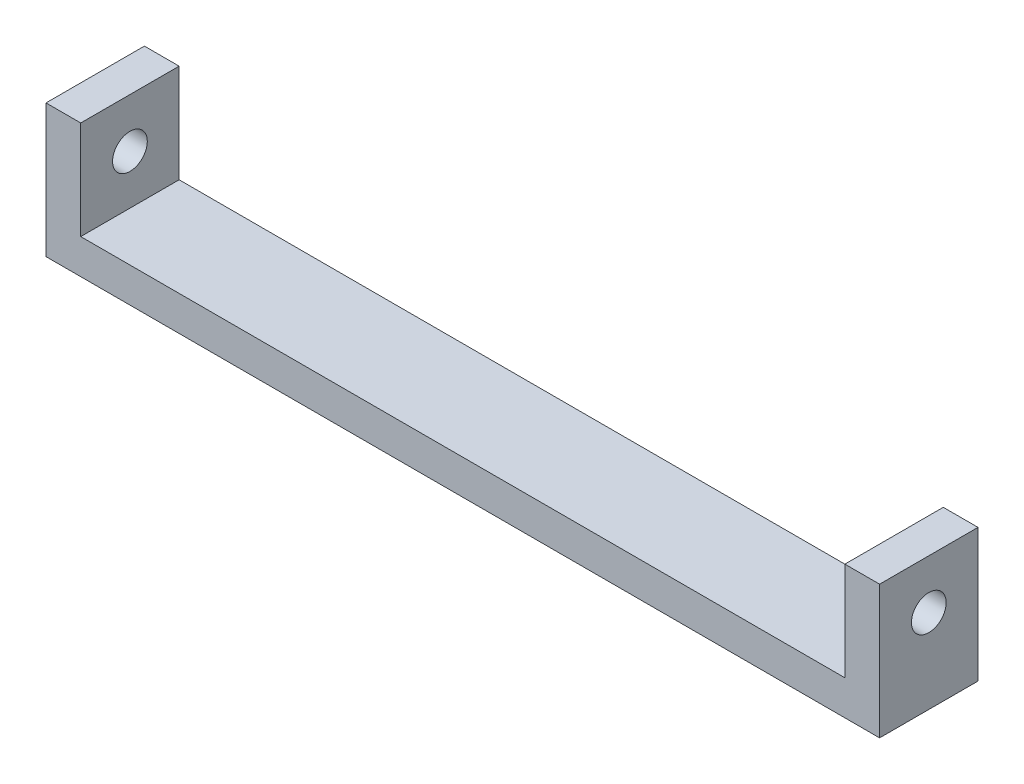
ISO-10303-21;
HEADER;
FILE_DESCRIPTION(('STEP AP214'),'2;1');
FILE_NAME('part.step','',(''),(''),'','','');
FILE_SCHEMA(('AUTOMOTIVE_DESIGN { 1 0 10303 214 1 1 1 1 }'));
ENDSEC;
DATA;
#1=APPLICATION_CONTEXT('core data for automotive mechanical design processes');
#2=APPLICATION_PROTOCOL_DEFINITION('international standard','automotive_design',2000,#1);
#3=PRODUCT_CONTEXT('',#1,'mechanical');
#4=PRODUCT('Part','Part','',(#3));
#5=PRODUCT_RELATED_PRODUCT_CATEGORY('part','',(#4));
#6=PRODUCT_DEFINITION_FORMATION('','',#4);
#7=PRODUCT_DEFINITION_CONTEXT('part definition',#1,'design');
#8=PRODUCT_DEFINITION('design','',#6,#7);
#9=PRODUCT_DEFINITION_SHAPE('','',#8);
#10=(LENGTH_UNIT() NAMED_UNIT(*) SI_UNIT(.MILLI.,.METRE.));
#11=(NAMED_UNIT(*) PLANE_ANGLE_UNIT() SI_UNIT($,.RADIAN.));
#12=(NAMED_UNIT(*) SI_UNIT($,.STERADIAN.) SOLID_ANGLE_UNIT());
#13=UNCERTAINTY_MEASURE_WITH_UNIT(LENGTH_MEASURE(1.E-05),#10,'distance_accuracy_value','');
#14=(GEOMETRIC_REPRESENTATION_CONTEXT(3) GLOBAL_UNCERTAINTY_ASSIGNED_CONTEXT((#13)) GLOBAL_UNIT_ASSIGNED_CONTEXT((#10,
#11,#12)) REPRESENTATION_CONTEXT('',''));
#15=CARTESIAN_POINT('',(0.,0.,0.));
#16=DIRECTION('',(0.,0.,1.));
#17=DIRECTION('',(1.,0.,0.));
#18=AXIS2_PLACEMENT_3D('',#15,#16,#17);
#19=CARTESIAN_POINT('',(5.,-4.25,-4.25));
#20=DIRECTION('',(0.,0.,1.));
#21=DIRECTION('',(1.,0.,0.));
#22=AXIS2_PLACEMENT_3D('',#19,#20,#21);
#23=PLANE('',#22);
#24=DIRECTION('',(0.,1.,0.));
#25=VECTOR('',#24,1.);
#26=CARTESIAN_POINT('',(74.,4.25,-4.25));
#27=LINE('',#26,#25);
#28=CARTESIAN_POINT('',(74.,-7.25,-4.25));
#29=VERTEX_POINT('',#28);
#30=CARTESIAN_POINT('',(74.,4.25,-4.25));
#31=VERTEX_POINT('',#30);
#32=EDGE_CURVE('E60',#29,#31,#27,.T.);
#33=ORIENTED_EDGE('',*,*,#32,.F.);
#34=DIRECTION('',(1.,0.,0.));
#35=VECTOR('',#34,1.);
#36=CARTESIAN_POINT('',(-2.,-7.25,-4.25));
#37=LINE('',#36,#35);
#38=CARTESIAN_POINT('',(2.,-7.25,-4.25));
#39=VERTEX_POINT('',#38);
#40=EDGE_CURVE('E125',#39,#29,#37,.T.);
#41=ORIENTED_EDGE('',*,*,#40,.F.);
#42=DIRECTION('',(0.,-1.,0.));
#43=VECTOR('',#42,1.);
#44=CARTESIAN_POINT('',(2.,4.25,-4.25));
#45=LINE('',#44,#43);
#46=CARTESIAN_POINT('',(2.,4.25,-4.25));
#47=VERTEX_POINT('',#46);
#48=EDGE_CURVE('E68',#47,#39,#45,.T.);
#49=ORIENTED_EDGE('',*,*,#48,.F.);
#50=DIRECTION('',(-1.,0.,0.));
#51=VECTOR('',#50,1.);
#52=CARTESIAN_POINT('',(5.,4.25,-4.25));
#53=LINE('',#52,#51);
#54=CARTESIAN_POINT('',(5.,4.25,-4.25));
#55=VERTEX_POINT('',#54);
#56=EDGE_CURVE('E11',#55,#47,#53,.T.);
#57=ORIENTED_EDGE('',*,*,#56,.F.);
#58=DIRECTION('',(0.,1.,0.));
#59=VECTOR('',#58,1.);
#60=CARTESIAN_POINT('',(5.,-4.25,-4.25));
#61=LINE('',#60,#59);
#62=CARTESIAN_POINT('',(5.,-4.25,-4.25));
#63=VERTEX_POINT('',#62);
#64=EDGE_CURVE('E133',#63,#55,#61,.T.);
#65=ORIENTED_EDGE('',*,*,#64,.F.);
#66=DIRECTION('',(1.,0.,0.));
#67=VECTOR('',#66,1.);
#68=CARTESIAN_POINT('',(-2.,-4.25,-4.25));
#69=LINE('',#68,#67);
#70=CARTESIAN_POINT('',(71.,-4.25,-4.25));
#71=VERTEX_POINT('',#70);
#72=EDGE_CURVE('E144',#63,#71,#69,.T.);
#73=ORIENTED_EDGE('',*,*,#72,.T.);
#74=DIRECTION('',(0.,-1.,0.));
#75=VECTOR('',#74,1.);
#76=CARTESIAN_POINT('',(71.,15.2613577727726,-4.25));
#77=LINE('',#76,#75);
#78=CARTESIAN_POINT('',(71.,4.25,-4.25));
#79=VERTEX_POINT('',#78);
#80=EDGE_CURVE('E225',#79,#71,#77,.T.);
#81=ORIENTED_EDGE('',*,*,#80,.F.);
#82=DIRECTION('',(1.,0.,0.));
#83=VECTOR('',#82,1.);
#84=CARTESIAN_POINT('',(78.,4.25,-4.25));
#85=LINE('',#84,#83);
#86=EDGE_CURVE('E148',#79,#31,#85,.T.);
#87=ORIENTED_EDGE('',*,*,#86,.T.);
#88=EDGE_LOOP('',(#33,#41,#49,#57,#65,#73,#81,#87));
#89=FACE_BOUND('',#88,.T.);
#90=ADVANCED_FACE('F43',(#89),#23,.F.);
#91=CARTESIAN_POINT('',(5.,-4.25,4.25));
#92=DIRECTION('',(0.,0.,-1.));
#93=DIRECTION('',(-1.,0.,0.));
#94=AXIS2_PLACEMENT_3D('',#91,#92,#93);
#95=PLANE('',#94);
#96=DIRECTION('',(0.,-1.,0.));
#97=VECTOR('',#96,1.);
#98=CARTESIAN_POINT('',(74.,4.25,4.25));
#99=LINE('',#98,#97);
#100=CARTESIAN_POINT('',(74.,4.25,4.25));
#101=VERTEX_POINT('',#100);
#102=CARTESIAN_POINT('',(74.,-7.25,4.25));
#103=VERTEX_POINT('',#102);
#104=EDGE_CURVE('E109',#101,#103,#99,.T.);
#105=ORIENTED_EDGE('',*,*,#104,.F.);
#106=DIRECTION('',(-1.,0.,0.));
#107=VECTOR('',#106,1.);
#108=CARTESIAN_POINT('',(78.,4.25,4.25));
#109=LINE('',#108,#107);
#110=CARTESIAN_POINT('',(71.,4.25,4.25));
#111=VERTEX_POINT('',#110);
#112=EDGE_CURVE('E216',#101,#111,#109,.T.);
#113=ORIENTED_EDGE('',*,*,#112,.T.);
#114=DIRECTION('',(0.,-1.,0.));
#115=VECTOR('',#114,1.);
#116=CARTESIAN_POINT('',(71.,15.2613577727726,4.25));
#117=LINE('',#116,#115);
#118=CARTESIAN_POINT('',(71.,-4.25,4.25));
#119=VERTEX_POINT('',#118);
#120=EDGE_CURVE('E222',#111,#119,#117,.T.);
#121=ORIENTED_EDGE('',*,*,#120,.T.);
#122=DIRECTION('',(-1.,0.,0.));
#123=VECTOR('',#122,1.);
#124=CARTESIAN_POINT('',(-2.,-4.25,4.25));
#125=LINE('',#124,#123);
#126=CARTESIAN_POINT('',(5.,-4.25,4.25));
#127=VERTEX_POINT('',#126);
#128=EDGE_CURVE('E140',#119,#127,#125,.T.);
#129=ORIENTED_EDGE('',*,*,#128,.T.);
#130=DIRECTION('',(0.,-1.,0.));
#131=VECTOR('',#130,1.);
#132=CARTESIAN_POINT('',(5.,-4.25,4.25));
#133=LINE('',#132,#131);
#134=CARTESIAN_POINT('',(5.,4.25,4.25));
#135=VERTEX_POINT('',#134);
#136=EDGE_CURVE('E153',#135,#127,#133,.T.);
#137=ORIENTED_EDGE('',*,*,#136,.F.);
#138=DIRECTION('',(-1.,0.,0.));
#139=VECTOR('',#138,1.);
#140=CARTESIAN_POINT('',(5.,4.25,4.25));
#141=LINE('',#140,#139);
#142=CARTESIAN_POINT('',(2.,4.25,4.25));
#143=VERTEX_POINT('',#142);
#144=EDGE_CURVE('E52',#135,#143,#141,.T.);
#145=ORIENTED_EDGE('',*,*,#144,.T.);
#146=DIRECTION('',(0.,1.,0.));
#147=VECTOR('',#146,1.);
#148=CARTESIAN_POINT('',(2.,4.25,4.25));
#149=LINE('',#148,#147);
#150=CARTESIAN_POINT('',(2.,-7.25,4.25));
#151=VERTEX_POINT('',#150);
#152=EDGE_CURVE('E131',#151,#143,#149,.T.);
#153=ORIENTED_EDGE('',*,*,#152,.F.);
#154=DIRECTION('',(-1.,0.,0.));
#155=VECTOR('',#154,1.);
#156=CARTESIAN_POINT('',(-2.,-7.25,4.25));
#157=LINE('',#156,#155);
#158=EDGE_CURVE('E123',#103,#151,#157,.T.);
#159=ORIENTED_EDGE('',*,*,#158,.F.);
#160=EDGE_LOOP('',(#105,#113,#121,#129,#137,#145,#153,#159));
#161=FACE_BOUND('',#160,.T.);
#162=ADVANCED_FACE('F129',(#161),#95,.F.);
#163=CARTESIAN_POINT('',(0.,-7.25,0.));
#164=DIRECTION('',(0.,-1.,0.));
#165=DIRECTION('',(0.,0.,-1.));
#166=AXIS2_PLACEMENT_3D('',#163,#164,#165);
#167=PLANE('',#166);
#168=ORIENTED_EDGE('',*,*,#40,.T.);
#169=DIRECTION('',(0.,0.,-1.));
#170=VECTOR('',#169,1.);
#171=CARTESIAN_POINT('',(74.,-7.25,4.25));
#172=LINE('',#171,#170);
#173=EDGE_CURVE('E112',#103,#29,#172,.T.);
#174=ORIENTED_EDGE('',*,*,#173,.F.);
#175=ORIENTED_EDGE('',*,*,#158,.T.);
#176=DIRECTION('',(0.,0.,1.));
#177=VECTOR('',#176,1.);
#178=CARTESIAN_POINT('',(2.,-7.25,-4.25));
#179=LINE('',#178,#177);
#180=EDGE_CURVE('E195',#39,#151,#179,.T.);
#181=ORIENTED_EDGE('',*,*,#180,.F.);
#182=EDGE_LOOP('',(#168,#174,#175,#181));
#183=FACE_BOUND('',#182,.T.);
#184=ADVANCED_FACE('F122',(#183),#167,.T.);
#185=CARTESIAN_POINT('',(5.,4.25,4.25));
#186=DIRECTION('',(0.,-1.,0.));
#187=DIRECTION('',(0.,0.,-1.));
#188=AXIS2_PLACEMENT_3D('',#185,#186,#187);
#189=PLANE('',#188);
#190=DIRECTION('',(0.,0.,1.));
#191=VECTOR('',#190,1.);
#192=CARTESIAN_POINT('',(74.,4.25,4.25));
#193=LINE('',#192,#191);
#194=EDGE_CURVE('E113',#31,#101,#193,.T.);
#195=ORIENTED_EDGE('',*,*,#194,.F.);
#196=ORIENTED_EDGE('',*,*,#86,.F.);
#197=DIRECTION('',(0.,0.,-1.));
#198=VECTOR('',#197,1.);
#199=CARTESIAN_POINT('',(71.,4.25,-4.25));
#200=LINE('',#199,#198);
#201=EDGE_CURVE('E212',#111,#79,#200,.T.);
#202=ORIENTED_EDGE('',*,*,#201,.F.);
#203=ORIENTED_EDGE('',*,*,#112,.F.);
#204=EDGE_LOOP('',(#195,#196,#202,#203));
#205=FACE_BOUND('',#204,.T.);
#206=ADVANCED_FACE('F231',(#205),#189,.F.);
#207=CARTESIAN_POINT('',(5.,4.25,4.25));
#208=DIRECTION('',(0.,-1.,0.));
#209=DIRECTION('',(0.,0.,-1.));
#210=AXIS2_PLACEMENT_3D('',#207,#208,#209);
#211=PLANE('',#210);
#212=DIRECTION('',(0.,0.,-1.));
#213=VECTOR('',#212,1.);
#214=CARTESIAN_POINT('',(2.,4.25,-4.25));
#215=LINE('',#214,#213);
#216=EDGE_CURVE('E200',#143,#47,#215,.T.);
#217=ORIENTED_EDGE('',*,*,#216,.F.);
#218=ORIENTED_EDGE('',*,*,#144,.F.);
#219=DIRECTION('',(0.,0.,1.));
#220=VECTOR('',#219,1.);
#221=CARTESIAN_POINT('',(5.,4.25,4.25));
#222=LINE('',#221,#220);
#223=EDGE_CURVE('E138',#55,#135,#222,.T.);
#224=ORIENTED_EDGE('',*,*,#223,.F.);
#225=ORIENTED_EDGE('',*,*,#56,.T.);
#226=EDGE_LOOP('',(#217,#218,#224,#225));
#227=FACE_BOUND('',#226,.T.);
#228=ADVANCED_FACE('F249',(#227),#211,.F.);
#229=CARTESIAN_POINT('',(0.,-4.25,0.));
#230=DIRECTION('',(0.,-1.,0.));
#231=DIRECTION('',(0.,0.,-1.));
#232=AXIS2_PLACEMENT_3D('',#229,#230,#231);
#233=PLANE('',#232);
#234=DIRECTION('',(0.,0.,1.));
#235=VECTOR('',#234,1.);
#236=CARTESIAN_POINT('',(71.,-4.25,-4.25));
#237=LINE('',#236,#235);
#238=EDGE_CURVE('E211',#71,#119,#237,.T.);
#239=ORIENTED_EDGE('',*,*,#238,.F.);
#240=ORIENTED_EDGE('',*,*,#72,.F.);
#241=DIRECTION('',(0.,0.,-1.));
#242=VECTOR('',#241,1.);
#243=CARTESIAN_POINT('',(5.,-4.25,4.25));
#244=LINE('',#243,#242);
#245=EDGE_CURVE('E157',#127,#63,#244,.T.);
#246=ORIENTED_EDGE('',*,*,#245,.F.);
#247=ORIENTED_EDGE('',*,*,#128,.F.);
#248=EDGE_LOOP('',(#239,#240,#246,#247));
#249=FACE_BOUND('',#248,.T.);
#250=ADVANCED_FACE('F239',(#249),#233,.F.);
#251=CARTESIAN_POINT('',(5.,0.,0.));
#252=DIRECTION('',(-1.,0.,0.));
#253=DIRECTION('',(0.,0.,1.));
#254=AXIS2_PLACEMENT_3D('',#251,#252,#253);
#255=PLANE('',#254);
#256=ORIENTED_EDGE('',*,*,#64,.T.);
#257=ORIENTED_EDGE('',*,*,#223,.T.);
#258=ORIENTED_EDGE('',*,*,#136,.T.);
#259=ORIENTED_EDGE('',*,*,#245,.T.);
#260=EDGE_LOOP('',(#256,#257,#258,#259));
#261=FACE_BOUND('',#260,.T.);
#262=CARTESIAN_POINT('',(5.,0.,0.));
#263=DIRECTION('',(1.,0.,0.));
#264=DIRECTION('',(0.,0.,-1.));
#265=AXIS2_PLACEMENT_3D('',#262,#263,#264);
#266=CIRCLE('',#265,1.5);
#267=CARTESIAN_POINT('',(5.,0.,-1.5));
#268=VERTEX_POINT('',#267);
#269=EDGE_CURVE('E207',#268,#268,#266,.T.);
#270=ORIENTED_EDGE('',*,*,#269,.F.);
#271=EDGE_LOOP('',(#270));
#272=FACE_BOUND('',#271,.T.);
#273=ADVANCED_FACE('F243',(#261,#272),#255,.F.);
#274=CARTESIAN_POINT('',(71.,15.2613577727726,-4.25));
#275=DIRECTION('',(1.,0.,0.));
#276=DIRECTION('',(0.,0.,-1.));
#277=AXIS2_PLACEMENT_3D('',#274,#275,#276);
#278=PLANE('',#277);
#279=ORIENTED_EDGE('',*,*,#120,.F.);
#280=ORIENTED_EDGE('',*,*,#201,.T.);
#281=ORIENTED_EDGE('',*,*,#80,.T.);
#282=ORIENTED_EDGE('',*,*,#238,.T.);
#283=EDGE_LOOP('',(#279,#280,#281,#282));
#284=FACE_BOUND('',#283,.T.);
#285=CARTESIAN_POINT('',(71.,0.,0.));
#286=DIRECTION('',(-1.,0.,0.));
#287=DIRECTION('',(0.,0.,1.));
#288=AXIS2_PLACEMENT_3D('',#285,#286,#287);
#289=CIRCLE('',#288,1.5);
#290=CARTESIAN_POINT('',(71.,0.,1.5));
#291=VERTEX_POINT('',#290);
#292=EDGE_CURVE('E203',#291,#291,#289,.T.);
#293=ORIENTED_EDGE('',*,*,#292,.F.);
#294=EDGE_LOOP('',(#293));
#295=FACE_BOUND('',#294,.T.);
#296=ADVANCED_FACE('F233',(#284,#295),#278,.F.);
#297=CARTESIAN_POINT('',(3.,0.,0.));
#298=DIRECTION('',(1.,0.,0.));
#299=DIRECTION('',(0.,0.,-1.));
#300=AXIS2_PLACEMENT_3D('',#297,#298,#299);
#301=CYLINDRICAL_SURFACE('',#300,1.5);
#302=ORIENTED_EDGE('',*,*,#269,.T.);
#303=EDGE_LOOP('',(#302));
#304=FACE_BOUND('',#303,.T.);
#305=CARTESIAN_POINT('',(2.,0.,0.));
#306=DIRECTION('',(-1.,0.,0.));
#307=DIRECTION('',(0.,0.,1.));
#308=AXIS2_PLACEMENT_3D('',#305,#306,#307);
#309=CIRCLE('',#308,1.5);
#310=CARTESIAN_POINT('',(2.,0.,1.5));
#311=VERTEX_POINT('',#310);
#312=EDGE_CURVE('E118',#311,#311,#309,.T.);
#313=ORIENTED_EDGE('',*,*,#312,.T.);
#314=EDGE_LOOP('',(#313));
#315=FACE_BOUND('',#314,.T.);
#316=ADVANCED_FACE('F263',(#304,#315),#301,.F.);
#317=CARTESIAN_POINT('',(73.,0.,0.));
#318=DIRECTION('',(-1.,0.,0.));
#319=DIRECTION('',(0.,0.,1.));
#320=AXIS2_PLACEMENT_3D('',#317,#318,#319);
#321=CYLINDRICAL_SURFACE('',#320,1.5);
#322=ORIENTED_EDGE('',*,*,#292,.T.);
#323=EDGE_LOOP('',(#322));
#324=FACE_BOUND('',#323,.T.);
#325=CARTESIAN_POINT('',(74.,0.,0.));
#326=DIRECTION('',(1.,0.,0.));
#327=DIRECTION('',(0.,0.,-1.));
#328=AXIS2_PLACEMENT_3D('',#325,#326,#327);
#329=CIRCLE('',#328,1.5);
#330=CARTESIAN_POINT('',(74.,0.,-1.5));
#331=VERTEX_POINT('',#330);
#332=EDGE_CURVE('E46',#331,#331,#329,.T.);
#333=ORIENTED_EDGE('',*,*,#332,.T.);
#334=EDGE_LOOP('',(#333));
#335=FACE_BOUND('',#334,.T.);
#336=ADVANCED_FACE('F170',(#324,#335),#321,.F.);
#337=CARTESIAN_POINT('',(2.,0.,0.));
#338=DIRECTION('',(-1.,0.,0.));
#339=DIRECTION('',(0.,0.,1.));
#340=AXIS2_PLACEMENT_3D('',#337,#338,#339);
#341=PLANE('',#340);
#342=ORIENTED_EDGE('',*,*,#312,.F.);
#343=EDGE_LOOP('',(#342));
#344=FACE_BOUND('',#343,.T.);
#345=ORIENTED_EDGE('',*,*,#48,.T.);
#346=ORIENTED_EDGE('',*,*,#180,.T.);
#347=ORIENTED_EDGE('',*,*,#152,.T.);
#348=ORIENTED_EDGE('',*,*,#216,.T.);
#349=EDGE_LOOP('',(#345,#346,#347,#348));
#350=FACE_BOUND('',#349,.T.);
#351=ADVANCED_FACE('F173',(#344,#350),#341,.T.);
#352=CARTESIAN_POINT('',(74.,0.,0.));
#353=DIRECTION('',(1.,0.,0.));
#354=DIRECTION('',(0.,0.,-1.));
#355=AXIS2_PLACEMENT_3D('',#352,#353,#354);
#356=PLANE('',#355);
#357=ORIENTED_EDGE('',*,*,#332,.F.);
#358=EDGE_LOOP('',(#357));
#359=FACE_BOUND('',#358,.T.);
#360=ORIENTED_EDGE('',*,*,#104,.T.);
#361=ORIENTED_EDGE('',*,*,#173,.T.);
#362=ORIENTED_EDGE('',*,*,#32,.T.);
#363=ORIENTED_EDGE('',*,*,#194,.T.);
#364=EDGE_LOOP('',(#360,#361,#362,#363));
#365=FACE_BOUND('',#364,.T.);
#366=ADVANCED_FACE('F111',(#359,#365),#356,.T.);
#367=CLOSED_SHELL('',(#90,#162,#184,#206,#228,#250,#273,#296,#316,#336,#351,#366));
#368=MANIFOLD_SOLID_BREP('B2',#367);
#369=ADVANCED_BREP_SHAPE_REPRESENTATION('',(#18,#368),#14);
#370=SHAPE_DEFINITION_REPRESENTATION(#9,#369);
ENDSEC;
END-ISO-10303-21;
